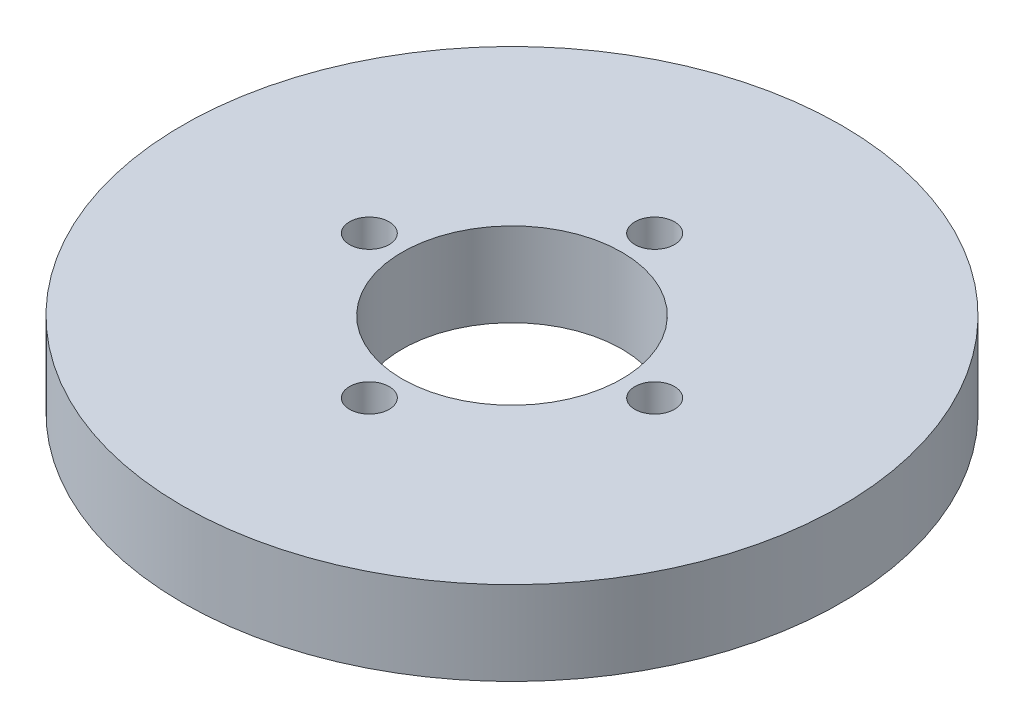
ISO-10303-21;
HEADER;
FILE_DESCRIPTION(('STEP AP214'),'2;1');
FILE_NAME('part.step','',(''),(''),'','','');
FILE_SCHEMA(('AUTOMOTIVE_DESIGN { 1 0 10303 214 1 1 1 1 }'));
ENDSEC;
DATA;
#1=APPLICATION_CONTEXT('core data for automotive mechanical design processes');
#2=APPLICATION_PROTOCOL_DEFINITION('international standard','automotive_design',2000,#1);
#3=PRODUCT_CONTEXT('',#1,'mechanical');
#4=PRODUCT('Part','Part','',(#3));
#5=PRODUCT_RELATED_PRODUCT_CATEGORY('part','',(#4));
#6=PRODUCT_DEFINITION_FORMATION('','',#4);
#7=PRODUCT_DEFINITION_CONTEXT('part definition',#1,'design');
#8=PRODUCT_DEFINITION('design','',#6,#7);
#9=PRODUCT_DEFINITION_SHAPE('','',#8);
#10=(LENGTH_UNIT() NAMED_UNIT(*) SI_UNIT(.MILLI.,.METRE.));
#11=(NAMED_UNIT(*) PLANE_ANGLE_UNIT() SI_UNIT($,.RADIAN.));
#12=(NAMED_UNIT(*) SI_UNIT($,.STERADIAN.) SOLID_ANGLE_UNIT());
#13=UNCERTAINTY_MEASURE_WITH_UNIT(LENGTH_MEASURE(1.E-05),#10,'distance_accuracy_value','');
#14=(GEOMETRIC_REPRESENTATION_CONTEXT(3) GLOBAL_UNCERTAINTY_ASSIGNED_CONTEXT((#13)) GLOBAL_UNIT_ASSIGNED_CONTEXT((#10,
#11,#12)) REPRESENTATION_CONTEXT('',''));
#15=CARTESIAN_POINT('',(0.,0.,0.));
#16=DIRECTION('',(0.,0.,1.));
#17=DIRECTION('',(1.,0.,0.));
#18=AXIS2_PLACEMENT_3D('',#15,#16,#17);
#19=CARTESIAN_POINT('',(0.,21.,0.));
#20=DIRECTION('',(0.,-1.,0.));
#21=DIRECTION('',(0.,0.,-1.));
#22=AXIS2_PLACEMENT_3D('',#19,#20,#21);
#23=CYLINDRICAL_SURFACE('',#22,82.5);
#24=CARTESIAN_POINT('',(0.,21.,0.));
#25=DIRECTION('',(0.,1.,0.));
#26=DIRECTION('',(0.,0.,1.));
#27=AXIS2_PLACEMENT_3D('',#24,#25,#26);
#28=CIRCLE('',#27,82.5);
#29=CARTESIAN_POINT('',(0.,21.,-82.5));
#30=VERTEX_POINT('',#29);
#31=EDGE_CURVE('E10',#30,#30,#28,.T.);
#32=CARTESIAN_POINT('',(0.,0.,0.));
#33=DIRECTION('',(0.,1.,0.));
#34=DIRECTION('',(0.,0.,1.));
#35=AXIS2_PLACEMENT_3D('',#32,#33,#34);
#36=CIRCLE('',#35,82.5);
#37=CARTESIAN_POINT('',(0.,0.,-82.5));
#38=VERTEX_POINT('',#37);
#39=EDGE_CURVE('E37',#38,#38,#36,.T.);
#40=CARTESIAN_POINT('',(0.,21.,-82.5));
#41=CARTESIAN_POINT('',(0.,20.78125,-82.5));
#42=CARTESIAN_POINT('',(0.,20.5625,-82.5));
#43=CARTESIAN_POINT('',(0.,20.125,-82.5));
#44=CARTESIAN_POINT('',(0.,19.90625,-82.5));
#45=CARTESIAN_POINT('',(0.,19.46875,-82.5));
#46=CARTESIAN_POINT('',(0.,19.25,-82.5));
#47=CARTESIAN_POINT('',(0.,18.8125,-82.5));
#48=CARTESIAN_POINT('',(0.,18.59375,-82.5));
#49=CARTESIAN_POINT('',(0.,18.15625,-82.5));
#50=CARTESIAN_POINT('',(0.,17.9375,-82.5));
#51=CARTESIAN_POINT('',(0.,17.5,-82.5));
#52=CARTESIAN_POINT('',(0.,17.28125,-82.5));
#53=CARTESIAN_POINT('',(0.,16.84375,-82.5));
#54=CARTESIAN_POINT('',(0.,16.625,-82.5));
#55=CARTESIAN_POINT('',(0.,16.1875,-82.5));
#56=CARTESIAN_POINT('',(0.,15.96875,-82.5));
#57=CARTESIAN_POINT('',(0.,15.53125,-82.5));
#58=CARTESIAN_POINT('',(0.,15.3125,-82.5));
#59=CARTESIAN_POINT('',(0.,14.875,-82.5));
#60=CARTESIAN_POINT('',(0.,14.65625,-82.5));
#61=CARTESIAN_POINT('',(0.,14.21875,-82.5));
#62=CARTESIAN_POINT('',(0.,14.,-82.5));
#63=CARTESIAN_POINT('',(0.,13.5625,-82.5));
#64=CARTESIAN_POINT('',(0.,13.34375,-82.5));
#65=CARTESIAN_POINT('',(0.,12.90625,-82.5));
#66=CARTESIAN_POINT('',(0.,12.6875,-82.5));
#67=CARTESIAN_POINT('',(0.,12.25,-82.5));
#68=CARTESIAN_POINT('',(0.,12.03125,-82.5));
#69=CARTESIAN_POINT('',(0.,11.59375,-82.5));
#70=CARTESIAN_POINT('',(0.,11.375,-82.5));
#71=CARTESIAN_POINT('',(0.,10.9375,-82.5));
#72=CARTESIAN_POINT('',(0.,10.71875,-82.5));
#73=CARTESIAN_POINT('',(0.,10.28125,-82.5));
#74=CARTESIAN_POINT('',(0.,10.0625,-82.5));
#75=CARTESIAN_POINT('',(0.,9.625,-82.5));
#76=CARTESIAN_POINT('',(0.,9.40625,-82.5));
#77=CARTESIAN_POINT('',(0.,8.96875,-82.5));
#78=CARTESIAN_POINT('',(0.,8.75,-82.5));
#79=CARTESIAN_POINT('',(0.,8.3125,-82.5));
#80=CARTESIAN_POINT('',(0.,8.09375,-82.5));
#81=CARTESIAN_POINT('',(0.,7.65625,-82.5));
#82=CARTESIAN_POINT('',(0.,7.4375,-82.5));
#83=CARTESIAN_POINT('',(0.,7.,-82.5));
#84=CARTESIAN_POINT('',(0.,6.78125,-82.5));
#85=CARTESIAN_POINT('',(0.,6.34375,-82.5));
#86=CARTESIAN_POINT('',(0.,6.125,-82.5));
#87=CARTESIAN_POINT('',(0.,5.6875,-82.5));
#88=CARTESIAN_POINT('',(0.,5.46875,-82.5));
#89=CARTESIAN_POINT('',(0.,5.03125,-82.5));
#90=CARTESIAN_POINT('',(0.,4.8125,-82.5));
#91=CARTESIAN_POINT('',(0.,4.375,-82.5));
#92=CARTESIAN_POINT('',(0.,4.15625,-82.5));
#93=CARTESIAN_POINT('',(0.,3.71875,-82.5));
#94=CARTESIAN_POINT('',(0.,3.5,-82.5));
#95=CARTESIAN_POINT('',(0.,3.0625,-82.5));
#96=CARTESIAN_POINT('',(0.,2.84375,-82.5));
#97=CARTESIAN_POINT('',(0.,2.40625,-82.5));
#98=CARTESIAN_POINT('',(0.,2.1875,-82.5));
#99=CARTESIAN_POINT('',(0.,1.75,-82.5));
#100=CARTESIAN_POINT('',(0.,1.53125,-82.5));
#101=CARTESIAN_POINT('',(0.,1.09375,-82.5));
#102=CARTESIAN_POINT('',(0.,0.875000000000001,-82.5));
#103=CARTESIAN_POINT('',(0.,0.4375,-82.5));
#104=CARTESIAN_POINT('',(0.,0.21875,-82.5));
#105=CARTESIAN_POINT('',(0.,0.,-82.5));
#106=B_SPLINE_CURVE_WITH_KNOTS('',3,(#40,#41,#42,#43,#44,#45,#46,#47,#48,#49,#50,#51,#52,#53,
#54,#55,#56,#57,#58,#59,#60,#61,#62,#63,#64,#65,#66,#67,#68,#69,#70,#71,#72,#73,#74,#75,#76,#77,
#78,#79,#80,#81,#82,#83,#84,#85,#86,#87,#88,#89,#90,#91,#92,#93,#94,#95,#96,#97,#98,#99,#100,
#101,#102,#103,#104,#105),.UNSPECIFIED.,.F.,.F.,(4,2,2,2,2,2,2,2,2,2,2,2,2,2,2,2,2,2,2,2,2,2,2,
2,2,2,2,2,2,2,2,2,4),(0.,0.656249999999997,1.3125,1.96875,2.625,3.28125,3.9375,4.59375,5.25,
5.90625,6.5625,7.21875,7.875,8.53125,9.1875,9.84375,10.5,11.15625,11.8125,12.46875,13.125,
13.78125,14.4375,15.09375,15.75,16.40625,17.0625,17.71875,18.375,19.03125,19.6875,20.34375,21.),.UNSPECIFIED.);
#107=EDGE_CURVE('BSEAM40',#30,#38,#106,.T.);
#108=ORIENTED_EDGE('',*,*,#31,.F.);
#109=ORIENTED_EDGE('',*,*,#39,.T.);
#110=ORIENTED_EDGE('',*,*,#107,.T.);
#111=ORIENTED_EDGE('',*,*,#107,.F.);
#112=EDGE_LOOP('',(#108,#110,#109,#111));
#113=FACE_BOUND('',#112,.T.);
#114=ADVANCED_FACE('F40',(#113),#23,.T.);
#115=CARTESIAN_POINT('',(0.,21.,0.));
#116=DIRECTION('',(0.,1.,0.));
#117=DIRECTION('',(0.,0.,1.));
#118=AXIS2_PLACEMENT_3D('',#115,#116,#117);
#119=PLANE('',#118);
#120=CARTESIAN_POINT('',(1.24698551583151E-13,21.,35.7150846535724));
#121=DIRECTION('',(0.,1.,0.));
#122=DIRECTION('',(1.,0.,0.));
#123=AXIS2_PLACEMENT_3D('',#120,#121,#122);
#124=CIRCLE('',#123,4.95791130271692);
#125=CARTESIAN_POINT('',(4.95791130271704,21.,35.7150846535723));
#126=VERTEX_POINT('',#125);
#127=EDGE_CURVE('E71',#126,#126,#124,.T.);
#128=ORIENTED_EDGE('',*,*,#127,.F.);
#129=EDGE_LOOP('',(#128));
#130=FACE_BOUND('',#129,.T.);
#131=CARTESIAN_POINT('',(35.7150846535724,21.,0.));
#132=DIRECTION('',(0.,1.,0.));
#133=DIRECTION('',(0.,0.,-1.));
#134=AXIS2_PLACEMENT_3D('',#131,#132,#133);
#135=CIRCLE('',#134,4.95791130271692);
#136=CARTESIAN_POINT('',(35.7150846535724,21.,-4.95791130271692));
#137=VERTEX_POINT('',#136);
#138=EDGE_CURVE('E70',#137,#137,#135,.T.);
#139=ORIENTED_EDGE('',*,*,#138,.F.);
#140=EDGE_LOOP('',(#139));
#141=FACE_BOUND('',#140,.T.);
#142=CARTESIAN_POINT('',(-3.74095654749452E-13,21.,-35.7150846535724));
#143=DIRECTION('',(0.,1.,0.));
#144=DIRECTION('',(-1.,0.,0.));
#145=AXIS2_PLACEMENT_3D('',#142,#143,#144);
#146=CIRCLE('',#145,4.95791130271692);
#147=CARTESIAN_POINT('',(-4.95791130271729,21.,-35.7150846535723));
#148=VERTEX_POINT('',#147);
#149=EDGE_CURVE('E61',#148,#148,#146,.T.);
#150=ORIENTED_EDGE('',*,*,#149,.F.);
#151=EDGE_LOOP('',(#150));
#152=FACE_BOUND('',#151,.T.);
#153=CARTESIAN_POINT('',(-35.7150846535724,21.,0.));
#154=DIRECTION('',(0.,1.,0.));
#155=DIRECTION('',(0.,0.,1.));
#156=AXIS2_PLACEMENT_3D('',#153,#154,#155);
#157=CIRCLE('',#156,4.95791130271692);
#158=CARTESIAN_POINT('',(-35.7150846535724,21.,4.95791130271692));
#159=VERTEX_POINT('',#158);
#160=EDGE_CURVE('E54',#159,#159,#157,.T.);
#161=ORIENTED_EDGE('',*,*,#160,.F.);
#162=EDGE_LOOP('',(#161));
#163=FACE_BOUND('',#162,.T.);
#164=CARTESIAN_POINT('',(0.,21.,0.));
#165=DIRECTION('',(0.,1.,0.));
#166=DIRECTION('',(0.,0.,1.));
#167=AXIS2_PLACEMENT_3D('',#164,#165,#166);
#168=CIRCLE('',#167,27.5);
#169=CARTESIAN_POINT('',(0.,21.,-27.5));
#170=VERTEX_POINT('',#169);
#171=EDGE_CURVE('E50',#170,#170,#168,.T.);
#172=ORIENTED_EDGE('',*,*,#171,.F.);
#173=EDGE_LOOP('',(#172));
#174=FACE_BOUND('',#173,.T.);
#175=ORIENTED_EDGE('',*,*,#31,.T.);
#176=EDGE_LOOP('',(#175));
#177=FACE_BOUND('',#176,.T.);
#178=ADVANCED_FACE('F86',(#130,#141,#152,#163,#174,#177),#119,.T.);
#179=CARTESIAN_POINT('',(0.,0.,0.));
#180=DIRECTION('',(0.,1.,0.));
#181=DIRECTION('',(0.,0.,1.));
#182=AXIS2_PLACEMENT_3D('',#179,#180,#181);
#183=PLANE('',#182);
#184=CARTESIAN_POINT('',(0.,0.,0.));
#185=DIRECTION('',(0.,1.,0.));
#186=DIRECTION('',(0.,0.,1.));
#187=AXIS2_PLACEMENT_3D('',#184,#185,#186);
#188=CIRCLE('',#187,27.5);
#189=CARTESIAN_POINT('',(0.,0.,-27.5));
#190=VERTEX_POINT('',#189);
#191=EDGE_CURVE('E47',#190,#190,#188,.T.);
#192=ORIENTED_EDGE('',*,*,#191,.T.);
#193=EDGE_LOOP('',(#192));
#194=FACE_BOUND('',#193,.T.);
#195=ORIENTED_EDGE('',*,*,#39,.F.);
#196=EDGE_LOOP('',(#195));
#197=FACE_BOUND('',#196,.T.);
#198=ADVANCED_FACE('F93',(#194,#197),#183,.F.);
#199=CARTESIAN_POINT('',(0.,21.,0.));
#200=DIRECTION('',(0.,-1.,0.));
#201=DIRECTION('',(0.,0.,-1.));
#202=AXIS2_PLACEMENT_3D('',#199,#200,#201);
#203=CYLINDRICAL_SURFACE('',#202,27.5);
#204=CARTESIAN_POINT('',(0.,21.,-27.5));
#205=CARTESIAN_POINT('',(0.,20.78125,-27.5));
#206=CARTESIAN_POINT('',(0.,20.5625,-27.5));
#207=CARTESIAN_POINT('',(0.,20.125,-27.5));
#208=CARTESIAN_POINT('',(0.,19.90625,-27.5));
#209=CARTESIAN_POINT('',(0.,19.46875,-27.5));
#210=CARTESIAN_POINT('',(0.,19.25,-27.5));
#211=CARTESIAN_POINT('',(0.,18.8125,-27.5));
#212=CARTESIAN_POINT('',(0.,18.59375,-27.5));
#213=CARTESIAN_POINT('',(0.,18.15625,-27.5));
#214=CARTESIAN_POINT('',(0.,17.9375,-27.5));
#215=CARTESIAN_POINT('',(0.,17.5,-27.5));
#216=CARTESIAN_POINT('',(0.,17.28125,-27.5));
#217=CARTESIAN_POINT('',(0.,16.84375,-27.5));
#218=CARTESIAN_POINT('',(0.,16.625,-27.5));
#219=CARTESIAN_POINT('',(0.,16.1875,-27.5));
#220=CARTESIAN_POINT('',(0.,15.96875,-27.5));
#221=CARTESIAN_POINT('',(0.,15.53125,-27.5));
#222=CARTESIAN_POINT('',(0.,15.3125,-27.5));
#223=CARTESIAN_POINT('',(0.,14.875,-27.5));
#224=CARTESIAN_POINT('',(0.,14.65625,-27.5));
#225=CARTESIAN_POINT('',(0.,14.21875,-27.5));
#226=CARTESIAN_POINT('',(0.,14.,-27.5));
#227=CARTESIAN_POINT('',(0.,13.5625,-27.5));
#228=CARTESIAN_POINT('',(0.,13.34375,-27.5));
#229=CARTESIAN_POINT('',(0.,12.90625,-27.5));
#230=CARTESIAN_POINT('',(0.,12.6875,-27.5));
#231=CARTESIAN_POINT('',(0.,12.25,-27.5));
#232=CARTESIAN_POINT('',(0.,12.03125,-27.5));
#233=CARTESIAN_POINT('',(0.,11.59375,-27.5));
#234=CARTESIAN_POINT('',(0.,11.375,-27.5));
#235=CARTESIAN_POINT('',(0.,10.9375,-27.5));
#236=CARTESIAN_POINT('',(0.,10.71875,-27.5));
#237=CARTESIAN_POINT('',(0.,10.28125,-27.5));
#238=CARTESIAN_POINT('',(0.,10.0625,-27.5));
#239=CARTESIAN_POINT('',(0.,9.625,-27.5));
#240=CARTESIAN_POINT('',(0.,9.40625,-27.5));
#241=CARTESIAN_POINT('',(0.,8.96875,-27.5));
#242=CARTESIAN_POINT('',(0.,8.75,-27.5));
#243=CARTESIAN_POINT('',(0.,8.3125,-27.5));
#244=CARTESIAN_POINT('',(0.,8.09375,-27.5));
#245=CARTESIAN_POINT('',(0.,7.65625,-27.5));
#246=CARTESIAN_POINT('',(0.,7.4375,-27.5));
#247=CARTESIAN_POINT('',(0.,7.,-27.5));
#248=CARTESIAN_POINT('',(0.,6.78125,-27.5));
#249=CARTESIAN_POINT('',(0.,6.34375,-27.5));
#250=CARTESIAN_POINT('',(0.,6.125,-27.5));
#251=CARTESIAN_POINT('',(0.,5.6875,-27.5));
#252=CARTESIAN_POINT('',(0.,5.46875,-27.5));
#253=CARTESIAN_POINT('',(0.,5.03125,-27.5));
#254=CARTESIAN_POINT('',(0.,4.8125,-27.5));
#255=CARTESIAN_POINT('',(0.,4.375,-27.5));
#256=CARTESIAN_POINT('',(0.,4.15625,-27.5));
#257=CARTESIAN_POINT('',(0.,3.71875,-27.5));
#258=CARTESIAN_POINT('',(0.,3.5,-27.5));
#259=CARTESIAN_POINT('',(0.,3.0625,-27.5));
#260=CARTESIAN_POINT('',(0.,2.84375,-27.5));
#261=CARTESIAN_POINT('',(0.,2.40625,-27.5));
#262=CARTESIAN_POINT('',(0.,2.1875,-27.5));
#263=CARTESIAN_POINT('',(0.,1.75,-27.5));
#264=CARTESIAN_POINT('',(0.,1.53125,-27.5));
#265=CARTESIAN_POINT('',(0.,1.09375,-27.5));
#266=CARTESIAN_POINT('',(0.,0.875000000000001,-27.5));
#267=CARTESIAN_POINT('',(0.,0.4375,-27.5));
#268=CARTESIAN_POINT('',(0.,0.21875,-27.5));
#269=CARTESIAN_POINT('',(0.,0.,-27.5));
#270=B_SPLINE_CURVE_WITH_KNOTS('',3,(#204,#205,#206,#207,#208,#209,#210,#211,#212,#213,#214,
#215,#216,#217,#218,#219,#220,#221,#222,#223,#224,#225,#226,#227,#228,#229,#230,#231,#232,#233,
#234,#235,#236,#237,#238,#239,#240,#241,#242,#243,#244,#245,#246,#247,#248,#249,#250,#251,#252,
#253,#254,#255,#256,#257,#258,#259,#260,#261,#262,#263,#264,#265,#266,#267,#268,#269),
.UNSPECIFIED.,.F.,.F.,(4,2,2,2,2,2,2,2,2,2,2,2,2,2,2,2,2,2,2,2,2,2,2,2,2,2,2,2,2,2,2,2,4),(0.,
0.656250000000001,1.3125,1.96875,2.625,3.28125,3.9375,4.59375,5.25,5.90625,6.5625,7.21875,7.875,
8.53125,9.1875,9.84375,10.5,11.15625,11.8125,12.46875,13.125,13.78125,14.4375,15.09375,15.75,
16.40625,17.0625,17.71875,18.375,19.03125,19.6875,20.34375,21.),.UNSPECIFIED.);
#271=EDGE_CURVE('BSEAM101',#170,#190,#270,.T.);
#272=ORIENTED_EDGE('',*,*,#171,.T.);
#273=ORIENTED_EDGE('',*,*,#191,.F.);
#274=ORIENTED_EDGE('',*,*,#271,.T.);
#275=ORIENTED_EDGE('',*,*,#271,.F.);
#276=EDGE_LOOP('',(#272,#274,#273,#275));
#277=FACE_BOUND('',#276,.T.);
#278=ADVANCED_FACE('F101',(#277),#203,.F.);
#279=CARTESIAN_POINT('',(-35.7150846535724,6.21421663719984,0.));
#280=DIRECTION('',(0.,1.,0.));
#281=DIRECTION('',(0.,0.,1.));
#282=AXIS2_PLACEMENT_3D('',#279,#280,#281);
#283=CYLINDRICAL_SURFACE('',#282,4.95791130271692);
#284=CARTESIAN_POINT('',(-35.7150846535724,6.21421663719984,0.));
#285=DIRECTION('',(0.,1.,0.));
#286=DIRECTION('',(0.,0.,1.));
#287=AXIS2_PLACEMENT_3D('',#284,#285,#286);
#288=CIRCLE('',#287,4.95791130271692);
#289=CARTESIAN_POINT('',(-35.7150846535724,6.21421663719984,4.95791130271692));
#290=VERTEX_POINT('',#289);
#291=EDGE_CURVE('E55',#290,#290,#288,.T.);
#292=ORIENTED_EDGE('',*,*,#291,.F.);
#293=EDGE_LOOP('',(#292));
#294=FACE_BOUND('',#293,.T.);
#295=ORIENTED_EDGE('',*,*,#160,.T.);
#296=EDGE_LOOP('',(#295));
#297=FACE_BOUND('',#296,.T.);
#298=ADVANCED_FACE('F102',(#294,#297),#283,.F.);
#299=CARTESIAN_POINT('',(-35.7150846535724,6.21421663719984,0.));
#300=DIRECTION('',(0.,1.,0.));
#301=DIRECTION('',(0.,0.,1.));
#302=AXIS2_PLACEMENT_3D('',#299,#300,#301);
#303=PLANE('',#302);
#304=ORIENTED_EDGE('',*,*,#291,.T.);
#305=EDGE_LOOP('',(#304));
#306=FACE_BOUND('',#305,.T.);
#307=ADVANCED_FACE('F133',(#306),#303,.T.);
#308=CARTESIAN_POINT('',(-3.74095654749452E-13,6.21421663719984,-35.7150846535724));
#309=DIRECTION('',(0.,1.,0.));
#310=DIRECTION('',(0.,0.,1.));
#311=AXIS2_PLACEMENT_3D('',#308,#309,#310);
#312=CYLINDRICAL_SURFACE('',#311,4.95791130271692);
#313=CARTESIAN_POINT('',(-3.74095654749452E-13,6.21421663719984,-35.7150846535724));
#314=DIRECTION('',(0.,1.,0.));
#315=DIRECTION('',(-1.,0.,0.));
#316=AXIS2_PLACEMENT_3D('',#313,#314,#315);
#317=CIRCLE('',#316,4.95791130271692);
#318=CARTESIAN_POINT('',(-4.95791130271729,6.21421663719984,-35.7150846535723));
#319=VERTEX_POINT('',#318);
#320=EDGE_CURVE('E63',#319,#319,#317,.T.);
#321=ORIENTED_EDGE('',*,*,#320,.F.);
#322=EDGE_LOOP('',(#321));
#323=FACE_BOUND('',#322,.T.);
#324=ORIENTED_EDGE('',*,*,#149,.T.);
#325=EDGE_LOOP('',(#324));
#326=FACE_BOUND('',#325,.T.);
#327=ADVANCED_FACE('F142',(#323,#326),#312,.F.);
#328=CARTESIAN_POINT('',(-3.74095654749452E-13,6.21421663719984,-35.7150846535724));
#329=DIRECTION('',(0.,1.,0.));
#330=DIRECTION('',(-1.,0.,0.));
#331=AXIS2_PLACEMENT_3D('',#328,#329,#330);
#332=PLANE('',#331);
#333=ORIENTED_EDGE('',*,*,#320,.T.);
#334=EDGE_LOOP('',(#333));
#335=FACE_BOUND('',#334,.T.);
#336=ADVANCED_FACE('F156',(#335),#332,.T.);
#337=CARTESIAN_POINT('',(35.7150846535724,6.21421663719984,0.));
#338=DIRECTION('',(0.,1.,0.));
#339=DIRECTION('',(0.,0.,1.));
#340=AXIS2_PLACEMENT_3D('',#337,#338,#339);
#341=CYLINDRICAL_SURFACE('',#340,4.95791130271692);
#342=CARTESIAN_POINT('',(35.7150846535724,6.21421663719984,0.));
#343=DIRECTION('',(0.,1.,0.));
#344=DIRECTION('',(0.,0.,-1.));
#345=AXIS2_PLACEMENT_3D('',#342,#343,#344);
#346=CIRCLE('',#345,4.95791130271692);
#347=CARTESIAN_POINT('',(35.7150846535724,6.21421663719984,-4.95791130271692));
#348=VERTEX_POINT('',#347);
#349=EDGE_CURVE('E69',#348,#348,#346,.T.);
#350=ORIENTED_EDGE('',*,*,#349,.F.);
#351=EDGE_LOOP('',(#350));
#352=FACE_BOUND('',#351,.T.);
#353=ORIENTED_EDGE('',*,*,#138,.T.);
#354=EDGE_LOOP('',(#353));
#355=FACE_BOUND('',#354,.T.);
#356=ADVANCED_FACE('F164',(#352,#355),#341,.F.);
#357=CARTESIAN_POINT('',(35.7150846535724,6.21421663719984,0.));
#358=DIRECTION('',(0.,1.,0.));
#359=DIRECTION('',(0.,0.,-1.));
#360=AXIS2_PLACEMENT_3D('',#357,#358,#359);
#361=PLANE('',#360);
#362=ORIENTED_EDGE('',*,*,#349,.T.);
#363=EDGE_LOOP('',(#362));
#364=FACE_BOUND('',#363,.T.);
#365=ADVANCED_FACE('F83',(#364),#361,.T.);
#366=CARTESIAN_POINT('',(1.24698551583151E-13,6.21421663719984,35.7150846535724));
#367=DIRECTION('',(0.,1.,0.));
#368=DIRECTION('',(0.,0.,1.));
#369=AXIS2_PLACEMENT_3D('',#366,#367,#368);
#370=CYLINDRICAL_SURFACE('',#369,4.95791130271692);
#371=CARTESIAN_POINT('',(1.24698551583151E-13,6.21421663719984,35.7150846535724));
#372=DIRECTION('',(0.,1.,0.));
#373=DIRECTION('',(1.,0.,0.));
#374=AXIS2_PLACEMENT_3D('',#371,#372,#373);
#375=CIRCLE('',#374,4.95791130271692);
#376=CARTESIAN_POINT('',(4.95791130271704,6.21421663719984,35.7150846535723));
#377=VERTEX_POINT('',#376);
#378=EDGE_CURVE('E59',#377,#377,#375,.T.);
#379=ORIENTED_EDGE('',*,*,#378,.F.);
#380=EDGE_LOOP('',(#379));
#381=FACE_BOUND('',#380,.T.);
#382=ORIENTED_EDGE('',*,*,#127,.T.);
#383=EDGE_LOOP('',(#382));
#384=FACE_BOUND('',#383,.T.);
#385=ADVANCED_FACE('F81',(#381,#384),#370,.F.);
#386=CARTESIAN_POINT('',(1.24698551583151E-13,6.21421663719984,35.7150846535724));
#387=DIRECTION('',(0.,1.,0.));
#388=DIRECTION('',(1.,0.,0.));
#389=AXIS2_PLACEMENT_3D('',#386,#387,#388);
#390=PLANE('',#389);
#391=ORIENTED_EDGE('',*,*,#378,.T.);
#392=EDGE_LOOP('',(#391));
#393=FACE_BOUND('',#392,.T.);
#394=ADVANCED_FACE('F78',(#393),#390,.T.);
#395=CLOSED_SHELL('',(#114,#178,#198,#278,#298,#307,#327,#336,#356,#365,#385,#394));
#396=MANIFOLD_SOLID_BREP('B2',#395);
#397=ADVANCED_BREP_SHAPE_REPRESENTATION('',(#18,#396),#14);
#398=SHAPE_DEFINITION_REPRESENTATION(#9,#397);
ENDSEC;
END-ISO-10303-21;
